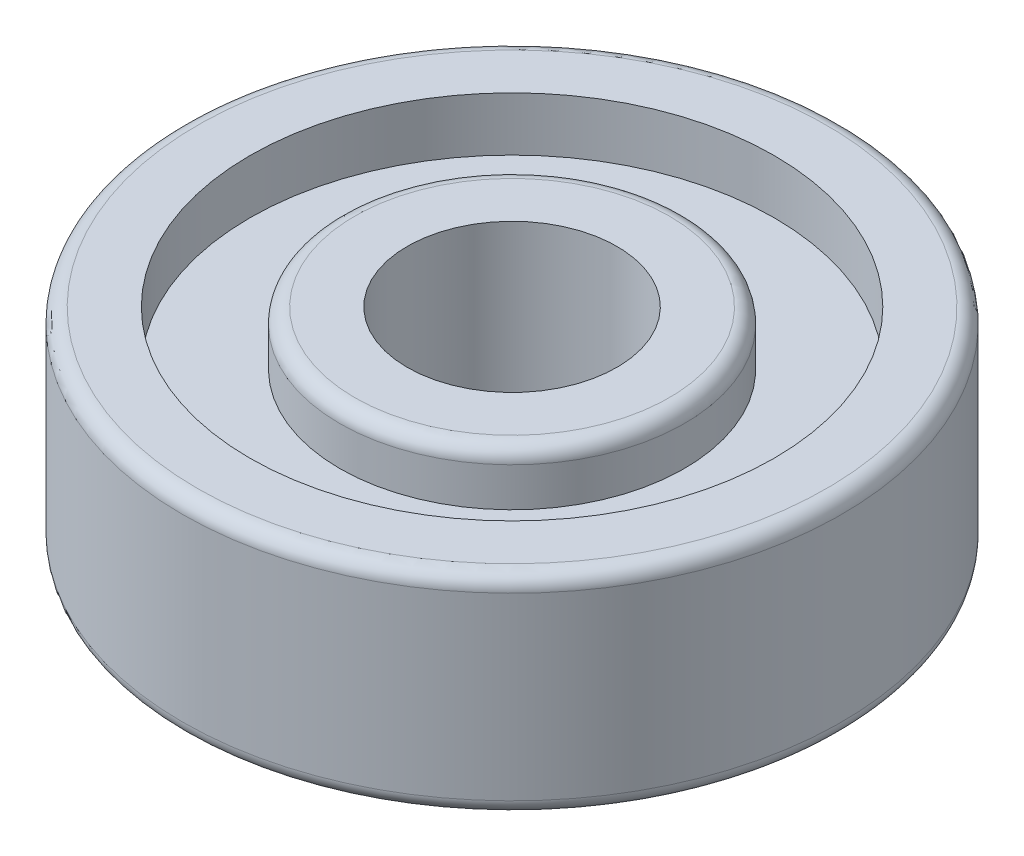
ISO-10303-21;
HEADER;
FILE_DESCRIPTION(('STEP AP214'),'2;1');
FILE_NAME('part.step','',(''),(''),'','','');
FILE_SCHEMA(('AUTOMOTIVE_DESIGN { 1 0 10303 214 1 1 1 1 }'));
ENDSEC;
DATA;
#1=APPLICATION_CONTEXT('core data for automotive mechanical design processes');
#2=APPLICATION_PROTOCOL_DEFINITION('international standard','automotive_design',2000,#1);
#3=PRODUCT_CONTEXT('',#1,'mechanical');
#4=PRODUCT('Part','Part','',(#3));
#5=PRODUCT_RELATED_PRODUCT_CATEGORY('part','',(#4));
#6=PRODUCT_DEFINITION_FORMATION('','',#4);
#7=PRODUCT_DEFINITION_CONTEXT('part definition',#1,'design');
#8=PRODUCT_DEFINITION('design','',#6,#7);
#9=PRODUCT_DEFINITION_SHAPE('','',#8);
#10=(LENGTH_UNIT() NAMED_UNIT(*) SI_UNIT(.MILLI.,.METRE.));
#11=(NAMED_UNIT(*) PLANE_ANGLE_UNIT() SI_UNIT($,.RADIAN.));
#12=(NAMED_UNIT(*) SI_UNIT($,.STERADIAN.) SOLID_ANGLE_UNIT());
#13=UNCERTAINTY_MEASURE_WITH_UNIT(LENGTH_MEASURE(1.E-05),#10,'distance_accuracy_value','');
#14=(GEOMETRIC_REPRESENTATION_CONTEXT(3) GLOBAL_UNCERTAINTY_ASSIGNED_CONTEXT((#13)) GLOBAL_UNIT_ASSIGNED_CONTEXT((#10,
#11,#12)) REPRESENTATION_CONTEXT('',''));
#15=CARTESIAN_POINT('',(0.,0.,0.));
#16=DIRECTION('',(0.,0.,1.));
#17=DIRECTION('',(1.,0.,0.));
#18=AXIS2_PLACEMENT_3D('',#15,#16,#17);
#19=CARTESIAN_POINT('',(0.,-3.5,0.));
#20=DIRECTION('',(0.,1.,0.));
#21=DIRECTION('',(0.,0.,1.));
#22=AXIS2_PLACEMENT_3D('',#19,#20,#21);
#23=PLANE('',#22);
#24=CARTESIAN_POINT('',(0.,-3.5,0.));
#25=DIRECTION('',(0.,1.,0.));
#26=DIRECTION('',(0.,0.,1.));
#27=AXIS2_PLACEMENT_3D('',#24,#25,#26);
#28=CIRCLE('',#27,10.5);
#29=CARTESIAN_POINT('',(0.,-3.5,10.5));
#30=VERTEX_POINT('',#29);
#31=EDGE_CURVE('E10',#30,#30,#28,.F.);
#32=ORIENTED_EDGE('',*,*,#31,.T.);
#33=EDGE_LOOP('',(#32));
#34=FACE_BOUND('',#33,.T.);
#35=CARTESIAN_POINT('',(0.,-3.5,0.));
#36=DIRECTION('',(0.,1.,0.));
#37=DIRECTION('',(0.,0.,1.));
#38=AXIS2_PLACEMENT_3D('',#35,#36,#37);
#39=CIRCLE('',#38,8.75);
#40=CARTESIAN_POINT('',(0.,-3.5,8.75));
#41=VERTEX_POINT('',#40);
#42=EDGE_CURVE('E78',#41,#41,#39,.T.);
#43=ORIENTED_EDGE('',*,*,#42,.T.);
#44=EDGE_LOOP('',(#43));
#45=FACE_BOUND('',#44,.T.);
#46=ADVANCED_FACE('F30',(#34,#45),#23,.F.);
#47=CARTESIAN_POINT('',(0.,3.5,0.));
#48=DIRECTION('',(0.,1.,0.));
#49=DIRECTION('',(0.,0.,1.));
#50=AXIS2_PLACEMENT_3D('',#47,#48,#49);
#51=PLANE('',#50);
#52=CARTESIAN_POINT('',(0.,3.5,0.));
#53=DIRECTION('',(0.,1.,0.));
#54=DIRECTION('',(0.,0.,1.));
#55=AXIS2_PLACEMENT_3D('',#52,#53,#54);
#56=CIRCLE('',#55,5.25);
#57=CARTESIAN_POINT('',(0.,3.5,5.25));
#58=VERTEX_POINT('',#57);
#59=EDGE_CURVE('E59',#58,#58,#56,.T.);
#60=ORIENTED_EDGE('',*,*,#59,.T.);
#61=EDGE_LOOP('',(#60));
#62=FACE_BOUND('',#61,.T.);
#63=CARTESIAN_POINT('',(0.,3.5,0.));
#64=DIRECTION('',(0.,1.,0.));
#65=DIRECTION('',(0.,0.,1.));
#66=AXIS2_PLACEMENT_3D('',#63,#64,#65);
#67=CIRCLE('',#66,3.5);
#68=CARTESIAN_POINT('',(0.,3.5,3.5));
#69=VERTEX_POINT('',#68);
#70=EDGE_CURVE('E63',#69,#69,#67,.T.);
#71=ORIENTED_EDGE('',*,*,#70,.F.);
#72=EDGE_LOOP('',(#71));
#73=FACE_BOUND('',#72,.T.);
#74=ADVANCED_FACE('F106',(#62,#73),#51,.T.);
#75=CARTESIAN_POINT('',(0.,3.5,0.));
#76=DIRECTION('',(0.,-1.,0.));
#77=DIRECTION('',(0.,0.,-1.));
#78=AXIS2_PLACEMENT_3D('',#75,#76,#77);
#79=CYLINDRICAL_SURFACE('',#78,11.);
#80=CARTESIAN_POINT('',(0.,3.,0.));
#81=DIRECTION('',(0.,1.,0.));
#82=DIRECTION('',(0.,0.,1.));
#83=AXIS2_PLACEMENT_3D('',#80,#81,#82);
#84=CIRCLE('',#83,11.);
#85=CARTESIAN_POINT('',(0.,3.,11.));
#86=VERTEX_POINT('',#85);
#87=EDGE_CURVE('E45',#86,#86,#84,.F.);
#88=ORIENTED_EDGE('',*,*,#87,.T.);
#89=EDGE_LOOP('',(#88));
#90=FACE_BOUND('',#89,.T.);
#91=CARTESIAN_POINT('',(0.,-3.,0.));
#92=DIRECTION('',(0.,1.,0.));
#93=DIRECTION('',(0.,0.,1.));
#94=AXIS2_PLACEMENT_3D('',#91,#92,#93);
#95=CIRCLE('',#94,11.);
#96=CARTESIAN_POINT('',(0.,-3.,11.));
#97=VERTEX_POINT('',#96);
#98=EDGE_CURVE('E50',#97,#97,#95,.T.);
#99=ORIENTED_EDGE('',*,*,#98,.T.);
#100=EDGE_LOOP('',(#99));
#101=FACE_BOUND('',#100,.T.);
#102=ADVANCED_FACE('F112',(#90,#101),#79,.T.);
#103=CARTESIAN_POINT('',(0.,3.5,0.));
#104=DIRECTION('',(0.,1.,0.));
#105=DIRECTION('',(0.,0.,1.));
#106=AXIS2_PLACEMENT_3D('',#103,#104,#105);
#107=CIRCLE('',#106,10.5);
#108=CARTESIAN_POINT('',(0.,3.5,10.5));
#109=VERTEX_POINT('',#108);
#110=EDGE_CURVE('E53',#109,#109,#107,.T.);
#111=ORIENTED_EDGE('',*,*,#110,.T.);
#112=EDGE_LOOP('',(#111));
#113=FACE_BOUND('',#112,.T.);
#114=CARTESIAN_POINT('',(0.,3.5,0.));
#115=DIRECTION('',(0.,1.,0.));
#116=DIRECTION('',(0.,0.,1.));
#117=AXIS2_PLACEMENT_3D('',#114,#115,#116);
#118=CIRCLE('',#117,8.75);
#119=CARTESIAN_POINT('',(0.,3.5,8.75));
#120=VERTEX_POINT('',#119);
#121=EDGE_CURVE('E69',#120,#120,#118,.T.);
#122=ORIENTED_EDGE('',*,*,#121,.F.);
#123=EDGE_LOOP('',(#122));
#124=FACE_BOUND('',#123,.T.);
#125=ADVANCED_FACE('F115',(#113,#124),#51,.T.);
#126=CARTESIAN_POINT('',(0.,-3.5,0.));
#127=DIRECTION('',(0.,1.,0.));
#128=DIRECTION('',(0.,0.,1.));
#129=AXIS2_PLACEMENT_3D('',#126,#127,#128);
#130=CIRCLE('',#129,5.25);
#131=CARTESIAN_POINT('',(0.,-3.5,5.25));
#132=VERTEX_POINT('',#131);
#133=EDGE_CURVE('E37',#132,#132,#130,.F.);
#134=ORIENTED_EDGE('',*,*,#133,.T.);
#135=EDGE_LOOP('',(#134));
#136=FACE_BOUND('',#135,.T.);
#137=CARTESIAN_POINT('',(0.,-3.5,0.));
#138=DIRECTION('',(0.,1.,0.));
#139=DIRECTION('',(0.,0.,1.));
#140=AXIS2_PLACEMENT_3D('',#137,#138,#139);
#141=CIRCLE('',#140,3.5);
#142=CARTESIAN_POINT('',(0.,-3.5,3.5));
#143=VERTEX_POINT('',#142);
#144=EDGE_CURVE('E62',#143,#143,#141,.T.);
#145=ORIENTED_EDGE('',*,*,#144,.T.);
#146=EDGE_LOOP('',(#145));
#147=FACE_BOUND('',#146,.T.);
#148=ADVANCED_FACE('F108',(#136,#147),#23,.F.);
#149=CARTESIAN_POINT('',(0.,-3.5,0.));
#150=DIRECTION('',(0.,1.,0.));
#151=DIRECTION('',(0.,0.,1.));
#152=AXIS2_PLACEMENT_3D('',#149,#150,#151);
#153=CYLINDRICAL_SURFACE('',#152,3.5);
#154=ORIENTED_EDGE('',*,*,#144,.F.);
#155=EDGE_LOOP('',(#154));
#156=FACE_BOUND('',#155,.T.);
#157=ORIENTED_EDGE('',*,*,#70,.T.);
#158=EDGE_LOOP('',(#157));
#159=FACE_BOUND('',#158,.T.);
#160=ADVANCED_FACE('F119',(#156,#159),#153,.F.);
#161=CARTESIAN_POINT('',(0.,1.7,0.));
#162=DIRECTION('',(0.,1.,0.));
#163=DIRECTION('',(0.,0.,1.));
#164=AXIS2_PLACEMENT_3D('',#161,#162,#163);
#165=CYLINDRICAL_SURFACE('',#164,5.75);
#166=CARTESIAN_POINT('',(0.,3.,0.));
#167=DIRECTION('',(0.,1.,0.));
#168=DIRECTION('',(0.,0.,1.));
#169=AXIS2_PLACEMENT_3D('',#166,#167,#168);
#170=CIRCLE('',#169,5.75);
#171=CARTESIAN_POINT('',(0.,3.,5.75));
#172=VERTEX_POINT('',#171);
#173=EDGE_CURVE('E56',#172,#172,#170,.F.);
#174=ORIENTED_EDGE('',*,*,#173,.T.);
#175=EDGE_LOOP('',(#174));
#176=FACE_BOUND('',#175,.T.);
#177=CARTESIAN_POINT('',(0.,1.7,0.));
#178=DIRECTION('',(0.,1.,0.));
#179=DIRECTION('',(0.,0.,1.));
#180=AXIS2_PLACEMENT_3D('',#177,#178,#179);
#181=CIRCLE('',#180,5.75);
#182=CARTESIAN_POINT('',(0.,1.7,5.75));
#183=VERTEX_POINT('',#182);
#184=EDGE_CURVE('E72',#183,#183,#181,.T.);
#185=ORIENTED_EDGE('',*,*,#184,.T.);
#186=EDGE_LOOP('',(#185));
#187=FACE_BOUND('',#186,.T.);
#188=ADVANCED_FACE('F124',(#176,#187),#165,.T.);
#189=CARTESIAN_POINT('',(0.,1.7,0.));
#190=DIRECTION('',(0.,1.,0.));
#191=DIRECTION('',(0.,0.,1.));
#192=AXIS2_PLACEMENT_3D('',#189,#190,#191);
#193=CYLINDRICAL_SURFACE('',#192,8.75);
#194=CARTESIAN_POINT('',(0.,1.7,0.));
#195=DIRECTION('',(0.,1.,0.));
#196=DIRECTION('',(0.,0.,1.));
#197=AXIS2_PLACEMENT_3D('',#194,#195,#196);
#198=CIRCLE('',#197,8.75);
#199=CARTESIAN_POINT('',(0.,1.7,8.75));
#200=VERTEX_POINT('',#199);
#201=EDGE_CURVE('E66',#200,#200,#198,.T.);
#202=ORIENTED_EDGE('',*,*,#201,.F.);
#203=EDGE_LOOP('',(#202));
#204=FACE_BOUND('',#203,.T.);
#205=ORIENTED_EDGE('',*,*,#121,.T.);
#206=EDGE_LOOP('',(#205));
#207=FACE_BOUND('',#206,.T.);
#208=ADVANCED_FACE('F102',(#204,#207),#193,.F.);
#209=CARTESIAN_POINT('',(0.,1.7,0.));
#210=DIRECTION('',(0.,1.,0.));
#211=DIRECTION('',(0.,0.,1.));
#212=AXIS2_PLACEMENT_3D('',#209,#210,#211);
#213=PLANE('',#212);
#214=ORIENTED_EDGE('',*,*,#184,.F.);
#215=EDGE_LOOP('',(#214));
#216=FACE_BOUND('',#215,.T.);
#217=ORIENTED_EDGE('',*,*,#201,.T.);
#218=EDGE_LOOP('',(#217));
#219=FACE_BOUND('',#218,.T.);
#220=ADVANCED_FACE('F93',(#216,#219),#213,.T.);
#221=CARTESIAN_POINT('',(0.,-1.7,0.));
#222=DIRECTION('',(0.,-1.,0.));
#223=DIRECTION('',(0.,0.,-1.));
#224=AXIS2_PLACEMENT_3D('',#221,#222,#223);
#225=CYLINDRICAL_SURFACE('',#224,5.75);
#226=CARTESIAN_POINT('',(0.,-3.,0.));
#227=DIRECTION('',(0.,1.,0.));
#228=DIRECTION('',(0.,0.,1.));
#229=AXIS2_PLACEMENT_3D('',#226,#227,#228);
#230=CIRCLE('',#229,5.75);
#231=CARTESIAN_POINT('',(0.,-3.,5.75));
#232=VERTEX_POINT('',#231);
#233=EDGE_CURVE('E41',#232,#232,#230,.T.);
#234=ORIENTED_EDGE('',*,*,#233,.T.);
#235=EDGE_LOOP('',(#234));
#236=FACE_BOUND('',#235,.T.);
#237=CARTESIAN_POINT('',(0.,-1.7,0.));
#238=DIRECTION('',(0.,1.,0.));
#239=DIRECTION('',(0.,0.,1.));
#240=AXIS2_PLACEMENT_3D('',#237,#238,#239);
#241=CIRCLE('',#240,5.75);
#242=CARTESIAN_POINT('',(0.,-1.7,5.75));
#243=VERTEX_POINT('',#242);
#244=EDGE_CURVE('E81',#243,#243,#241,.T.);
#245=ORIENTED_EDGE('',*,*,#244,.F.);
#246=EDGE_LOOP('',(#245));
#247=FACE_BOUND('',#246,.T.);
#248=ADVANCED_FACE('F90',(#236,#247),#225,.T.);
#249=CARTESIAN_POINT('',(0.,-1.7,0.));
#250=DIRECTION('',(0.,-1.,0.));
#251=DIRECTION('',(0.,0.,-1.));
#252=AXIS2_PLACEMENT_3D('',#249,#250,#251);
#253=CYLINDRICAL_SURFACE('',#252,8.75);
#254=CARTESIAN_POINT('',(0.,-1.7,0.));
#255=DIRECTION('',(0.,1.,0.));
#256=DIRECTION('',(0.,0.,1.));
#257=AXIS2_PLACEMENT_3D('',#254,#255,#256);
#258=CIRCLE('',#257,8.75);
#259=CARTESIAN_POINT('',(0.,-1.7,8.75));
#260=VERTEX_POINT('',#259);
#261=EDGE_CURVE('E73',#260,#260,#258,.T.);
#262=ORIENTED_EDGE('',*,*,#261,.T.);
#263=EDGE_LOOP('',(#262));
#264=FACE_BOUND('',#263,.T.);
#265=ORIENTED_EDGE('',*,*,#42,.F.);
#266=EDGE_LOOP('',(#265));
#267=FACE_BOUND('',#266,.T.);
#268=ADVANCED_FACE('F92',(#264,#267),#253,.F.);
#269=CARTESIAN_POINT('',(0.,-1.7,0.));
#270=DIRECTION('',(0.,-1.,0.));
#271=DIRECTION('',(0.,0.,1.));
#272=AXIS2_PLACEMENT_3D('',#269,#270,#271);
#273=PLANE('',#272);
#274=ORIENTED_EDGE('',*,*,#244,.T.);
#275=EDGE_LOOP('',(#274));
#276=FACE_BOUND('',#275,.T.);
#277=ORIENTED_EDGE('',*,*,#261,.F.);
#278=EDGE_LOOP('',(#277));
#279=FACE_BOUND('',#278,.T.);
#280=ADVANCED_FACE('F87',(#276,#279),#273,.T.);
#281=CARTESIAN_POINT('',(0.,3.,0.));
#282=DIRECTION('',(0.,1.,0.));
#283=DIRECTION('',(0.,0.,1.));
#284=AXIS2_PLACEMENT_3D('',#281,#282,#283);
#285=TOROIDAL_SURFACE('',#284,5.25,0.5);
#286=ORIENTED_EDGE('',*,*,#173,.F.);
#287=EDGE_LOOP('',(#286));
#288=FACE_BOUND('',#287,.T.);
#289=ORIENTED_EDGE('',*,*,#59,.F.);
#290=EDGE_LOOP('',(#289));
#291=FACE_BOUND('',#290,.T.);
#292=ADVANCED_FACE('F173',(#288,#291),#285,.T.);
#293=CARTESIAN_POINT('',(0.,3.,0.));
#294=DIRECTION('',(0.,1.,0.));
#295=DIRECTION('',(0.,0.,1.));
#296=AXIS2_PLACEMENT_3D('',#293,#294,#295);
#297=TOROIDAL_SURFACE('',#296,10.5,0.5);
#298=ORIENTED_EDGE('',*,*,#87,.F.);
#299=EDGE_LOOP('',(#298));
#300=FACE_BOUND('',#299,.T.);
#301=ORIENTED_EDGE('',*,*,#110,.F.);
#302=EDGE_LOOP('',(#301));
#303=FACE_BOUND('',#302,.T.);
#304=ADVANCED_FACE('F214',(#300,#303),#297,.T.);
#305=CARTESIAN_POINT('',(0.,-3.,0.));
#306=DIRECTION('',(0.,1.,0.));
#307=DIRECTION('',(0.,0.,1.));
#308=AXIS2_PLACEMENT_3D('',#305,#306,#307);
#309=TOROIDAL_SURFACE('',#308,5.25,0.5);
#310=ORIENTED_EDGE('',*,*,#133,.F.);
#311=EDGE_LOOP('',(#310));
#312=FACE_BOUND('',#311,.T.);
#313=ORIENTED_EDGE('',*,*,#233,.F.);
#314=EDGE_LOOP('',(#313));
#315=FACE_BOUND('',#314,.T.);
#316=ADVANCED_FACE('F224',(#312,#315),#309,.T.);
#317=CARTESIAN_POINT('',(0.,-3.,0.));
#318=DIRECTION('',(0.,1.,0.));
#319=DIRECTION('',(0.,0.,1.));
#320=AXIS2_PLACEMENT_3D('',#317,#318,#319);
#321=TOROIDAL_SURFACE('',#320,10.5,0.5);
#322=ORIENTED_EDGE('',*,*,#31,.F.);
#323=EDGE_LOOP('',(#322));
#324=FACE_BOUND('',#323,.T.);
#325=ORIENTED_EDGE('',*,*,#98,.F.);
#326=EDGE_LOOP('',(#325));
#327=FACE_BOUND('',#326,.T.);
#328=ADVANCED_FACE('F32',(#324,#327),#321,.T.);
#329=CLOSED_SHELL('',(#46,#74,#102,#125,#148,#160,#188,#208,#220,#248,#268,#280,#292,#304,#316,#328));
#330=MANIFOLD_SOLID_BREP('B2',#329);
#331=ADVANCED_BREP_SHAPE_REPRESENTATION('',(#18,#330),#14);
#332=SHAPE_DEFINITION_REPRESENTATION(#9,#331);
ENDSEC;
END-ISO-10303-21;
